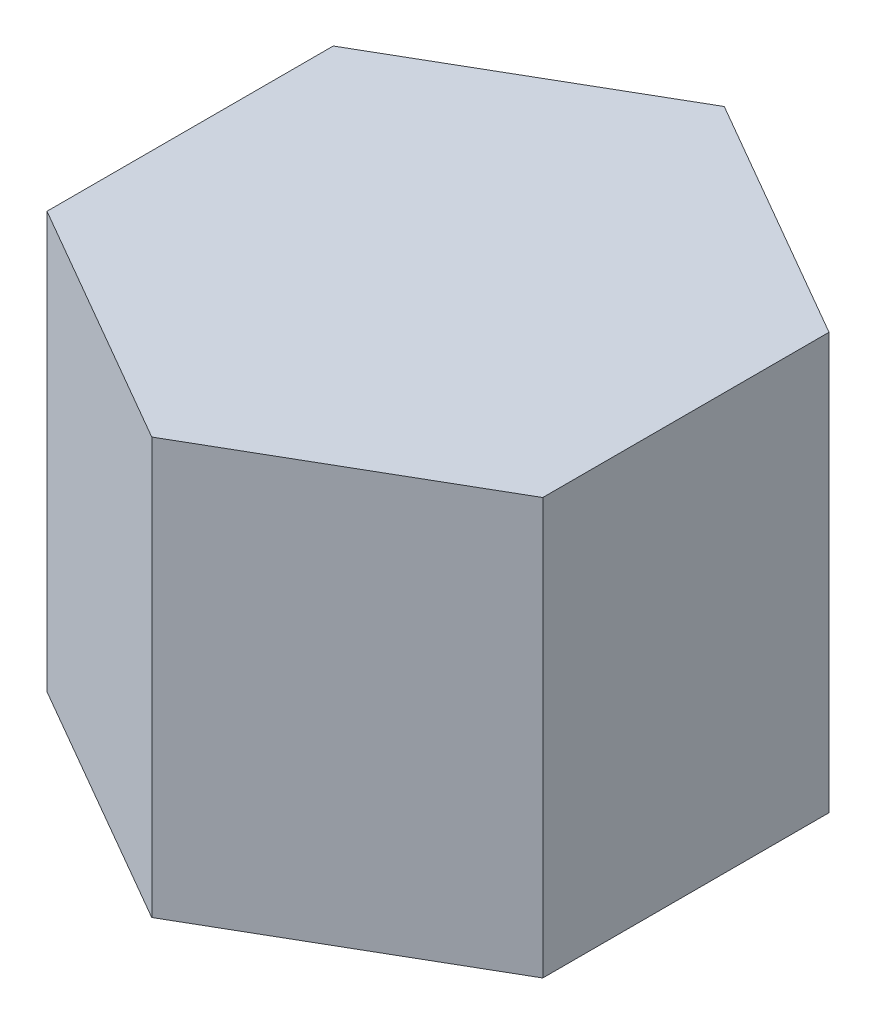
ISO-10303-21;
HEADER;
FILE_DESCRIPTION(('STEP AP214'),'2;1');
FILE_NAME('part.step','',(''),(''),'','','');
FILE_SCHEMA(('AUTOMOTIVE_DESIGN { 1 0 10303 214 1 1 1 1 }'));
ENDSEC;
DATA;
#1=APPLICATION_CONTEXT('core data for automotive mechanical design processes');
#2=APPLICATION_PROTOCOL_DEFINITION('international standard','automotive_design',2000,#1);
#3=PRODUCT_CONTEXT('',#1,'mechanical');
#4=PRODUCT('Part','Part','',(#3));
#5=PRODUCT_RELATED_PRODUCT_CATEGORY('part','',(#4));
#6=PRODUCT_DEFINITION_FORMATION('','',#4);
#7=PRODUCT_DEFINITION_CONTEXT('part definition',#1,'design');
#8=PRODUCT_DEFINITION('design','',#6,#7);
#9=PRODUCT_DEFINITION_SHAPE('','',#8);
#10=(LENGTH_UNIT() NAMED_UNIT(*) SI_UNIT(.MILLI.,.METRE.));
#11=(NAMED_UNIT(*) PLANE_ANGLE_UNIT() SI_UNIT($,.RADIAN.));
#12=(NAMED_UNIT(*) SI_UNIT($,.STERADIAN.) SOLID_ANGLE_UNIT());
#13=UNCERTAINTY_MEASURE_WITH_UNIT(LENGTH_MEASURE(1.E-05),#10,'distance_accuracy_value','');
#14=(GEOMETRIC_REPRESENTATION_CONTEXT(3) GLOBAL_UNCERTAINTY_ASSIGNED_CONTEXT((#13)) GLOBAL_UNIT_ASSIGNED_CONTEXT((#10,
#11,#12)) REPRESENTATION_CONTEXT('',''));
#15=CARTESIAN_POINT('',(0.,0.,0.));
#16=DIRECTION('',(0.,0.,1.));
#17=DIRECTION('',(1.,0.,0.));
#18=AXIS2_PLACEMENT_3D('',#15,#16,#17);
#19=CARTESIAN_POINT('',(209.839551417381,-147.556598747966,296.012098239417));
#20=DIRECTION('',(-0.500000000000062,0.,-0.866025403784403));
#21=DIRECTION('',(-0.866025403784403,0.,0.500000000000062));
#22=AXIS2_PLACEMENT_3D('',#19,#20,#21);
#23=PLANE('',#22);
#24=CARTESIAN_POINT('',(210.142660308706,-147.047793579175,295.837098239417));
#25=DIRECTION('',(-0.866025403784403,0.,0.500000000000062));
#26=VECTOR('',#25,1.);
#27=LINE('',#24,#26);
#28=CARTESIAN_POINT('',(210.142660308706,-147.047793579175,295.837098239417));
#29=VERTEX_POINT('',#28);
#30=CARTESIAN_POINT('',(209.839551417382,-147.047793579175,296.012098239417));
#31=VERTEX_POINT('',#30);
#32=EDGE_CURVE('E170',#29,#31,#27,.T.);
#33=ORIENTED_EDGE('',*,*,#32,.T.);
#34=CARTESIAN_POINT('',(209.839551417382,-147.556598747966,296.012098239417));
#35=DIRECTION('',(0.,1.,0.));
#36=VECTOR('',#35,1.);
#37=LINE('',#34,#36);
#38=CARTESIAN_POINT('',(209.839551417382,-147.556598747966,296.012098239417));
#39=VERTEX_POINT('',#38);
#40=EDGE_CURVE('E35',#39,#31,#37,.T.);
#41=ORIENTED_EDGE('',*,*,#40,.F.);
#42=CARTESIAN_POINT('',(210.142660308706,-147.556598747966,295.837098239417));
#43=DIRECTION('',(-0.866025403784403,0.,0.500000000000062));
#44=VECTOR('',#43,1.);
#45=LINE('',#42,#44);
#46=CARTESIAN_POINT('',(210.142660308706,-147.556598747966,295.837098239417));
#47=VERTEX_POINT('',#46);
#48=EDGE_CURVE('E159',#47,#39,#45,.T.);
#49=ORIENTED_EDGE('',*,*,#48,.F.);
#50=CARTESIAN_POINT('',(210.142660308706,-147.556598747966,295.837098239417));
#51=DIRECTION('',(0.,1.,0.));
#52=VECTOR('',#51,1.);
#53=LINE('',#50,#52);
#54=EDGE_CURVE('E10',#47,#29,#53,.T.);
#55=ORIENTED_EDGE('',*,*,#54,.T.);
#56=EDGE_LOOP('',(#33,#41,#49,#55));
#57=FACE_BOUND('',#56,.T.);
#58=ADVANCED_FACE('F16',(#57),#23,.F.);
#59=CARTESIAN_POINT('',(210.142660308706,-147.556598747966,291.594471220494));
#60=DIRECTION('',(-1.,0.,0.));
#61=DIRECTION('',(0.,-1.,0.));
#62=AXIS2_PLACEMENT_3D('',#59,#60,#61);
#63=PLANE('',#62);
#64=CARTESIAN_POINT('',(210.142660308706,-147.047793579175,295.487098239417));
#65=DIRECTION('',(0.,0.,1.));
#66=VECTOR('',#65,1.);
#67=LINE('',#64,#66);
#68=CARTESIAN_POINT('',(210.142660308706,-147.047793579175,295.487098239417));
#69=VERTEX_POINT('',#68);
#70=EDGE_CURVE('E167',#69,#29,#67,.T.);
#71=ORIENTED_EDGE('',*,*,#70,.T.);
#72=ORIENTED_EDGE('',*,*,#54,.F.);
#73=CARTESIAN_POINT('',(210.142660308706,-147.556598747966,295.487098239417));
#74=DIRECTION('',(0.,0.,1.));
#75=VECTOR('',#74,1.);
#76=LINE('',#73,#75);
#77=CARTESIAN_POINT('',(210.142660308706,-147.556598747966,295.487098239417));
#78=VERTEX_POINT('',#77);
#79=EDGE_CURVE('E156',#78,#47,#76,.T.);
#80=ORIENTED_EDGE('',*,*,#79,.F.);
#81=CARTESIAN_POINT('',(210.142660308706,-147.556598747966,295.487098239417));
#82=DIRECTION('',(0.,1.,0.));
#83=VECTOR('',#82,1.);
#84=LINE('',#81,#83);
#85=EDGE_CURVE('E27',#78,#69,#84,.T.);
#86=ORIENTED_EDGE('',*,*,#85,.T.);
#87=EDGE_LOOP('',(#71,#72,#80,#86));
#88=FACE_BOUND('',#87,.T.);
#89=ADVANCED_FACE('F189',(#88),#63,.F.);
#90=CARTESIAN_POINT('',(210.142660308706,-147.556598747966,295.487098239417));
#91=DIRECTION('',(-0.500000000000096,0.,0.866025403784383));
#92=DIRECTION('',(0.866025403784383,0.,0.500000000000096));
#93=AXIS2_PLACEMENT_3D('',#90,#91,#92);
#94=PLANE('',#93);
#95=CARTESIAN_POINT('',(209.839551417382,-147.047793579175,295.312098239417));
#96=DIRECTION('',(0.866025403784383,0.,0.500000000000096));
#97=VECTOR('',#96,1.);
#98=LINE('',#95,#97);
#99=CARTESIAN_POINT('',(209.839551417382,-147.047793579175,295.312098239417));
#100=VERTEX_POINT('',#99);
#101=EDGE_CURVE('E163',#100,#69,#98,.T.);
#102=ORIENTED_EDGE('',*,*,#101,.T.);
#103=ORIENTED_EDGE('',*,*,#85,.F.);
#104=CARTESIAN_POINT('',(209.839551417382,-147.556598747966,295.312098239417));
#105=DIRECTION('',(0.866025403784383,0.,0.500000000000096));
#106=VECTOR('',#105,1.);
#107=LINE('',#104,#106);
#108=CARTESIAN_POINT('',(209.839551417382,-147.556598747966,295.312098239417));
#109=VERTEX_POINT('',#108);
#110=EDGE_CURVE('E106',#109,#78,#107,.T.);
#111=ORIENTED_EDGE('',*,*,#110,.F.);
#112=CARTESIAN_POINT('',(209.839551417382,-147.556598747966,295.312098239417));
#113=DIRECTION('',(0.,1.,0.));
#114=VECTOR('',#113,1.);
#115=LINE('',#112,#114);
#116=EDGE_CURVE('E94',#109,#100,#115,.T.);
#117=ORIENTED_EDGE('',*,*,#116,.T.);
#118=EDGE_LOOP('',(#102,#103,#111,#117));
#119=FACE_BOUND('',#118,.T.);
#120=ADVANCED_FACE('F198',(#119),#94,.F.);
#121=CARTESIAN_POINT('',(209.839551417382,-147.556598747966,295.312098239417));
#122=DIRECTION('',(0.499999999999978,0.,0.866025403784452));
#123=DIRECTION('',(0.866025403784452,0.,-0.499999999999978));
#124=AXIS2_PLACEMENT_3D('',#121,#122,#123);
#125=PLANE('',#124);
#126=CARTESIAN_POINT('',(209.536442526057,-147.047793579175,295.487098239417));
#127=DIRECTION('',(0.866025403784452,0.,-0.499999999999978));
#128=VECTOR('',#127,1.);
#129=LINE('',#126,#128);
#130=CARTESIAN_POINT('',(209.536442526057,-147.047793579175,295.487098239417));
#131=VERTEX_POINT('',#130);
#132=EDGE_CURVE('E162',#131,#100,#129,.T.);
#133=ORIENTED_EDGE('',*,*,#132,.T.);
#134=ORIENTED_EDGE('',*,*,#116,.F.);
#135=CARTESIAN_POINT('',(209.536442526057,-147.556598747966,295.487098239417));
#136=DIRECTION('',(0.866025403784452,0.,-0.499999999999978));
#137=VECTOR('',#136,1.);
#138=LINE('',#135,#137);
#139=CARTESIAN_POINT('',(209.536442526057,-147.556598747966,295.487098239417));
#140=VERTEX_POINT('',#139);
#141=EDGE_CURVE('E98',#140,#109,#138,.T.);
#142=ORIENTED_EDGE('',*,*,#141,.F.);
#143=CARTESIAN_POINT('',(209.536442526057,-147.556598747966,295.487098239417));
#144=DIRECTION('',(0.,1.,0.));
#145=VECTOR('',#144,1.);
#146=LINE('',#143,#145);
#147=EDGE_CURVE('E79',#140,#131,#146,.T.);
#148=ORIENTED_EDGE('',*,*,#147,.T.);
#149=EDGE_LOOP('',(#133,#134,#142,#148));
#150=FACE_BOUND('',#149,.T.);
#151=ADVANCED_FACE('F100',(#150),#125,.F.);
#152=CARTESIAN_POINT('',(209.536442526057,-147.556598747966,291.594471220494));
#153=DIRECTION('',(1.,0.,0.));
#154=DIRECTION('',(0.,1.,0.));
#155=AXIS2_PLACEMENT_3D('',#152,#153,#154);
#156=PLANE('',#155);
#157=CARTESIAN_POINT('',(209.536442526057,-147.047793579175,295.837098239417));
#158=DIRECTION('',(0.,0.,-1.));
#159=VECTOR('',#158,1.);
#160=LINE('',#157,#159);
#161=CARTESIAN_POINT('',(209.536442526057,-147.047793579175,295.837098239417));
#162=VERTEX_POINT('',#161);
#163=EDGE_CURVE('E88',#162,#131,#160,.T.);
#164=ORIENTED_EDGE('',*,*,#163,.T.);
#165=ORIENTED_EDGE('',*,*,#147,.F.);
#166=CARTESIAN_POINT('',(209.536442526057,-147.556598747966,295.837098239417));
#167=DIRECTION('',(0.,0.,-1.));
#168=VECTOR('',#167,1.);
#169=LINE('',#166,#168);
#170=CARTESIAN_POINT('',(209.536442526057,-147.556598747966,295.837098239417));
#171=VERTEX_POINT('',#170);
#172=EDGE_CURVE('E84',#171,#140,#169,.T.);
#173=ORIENTED_EDGE('',*,*,#172,.F.);
#174=CARTESIAN_POINT('',(209.536442526057,-147.556598747966,295.837098239417));
#175=DIRECTION('',(0.,1.,0.));
#176=VECTOR('',#175,1.);
#177=LINE('',#174,#176);
#178=EDGE_CURVE('E58',#171,#162,#177,.T.);
#179=ORIENTED_EDGE('',*,*,#178,.T.);
#180=EDGE_LOOP('',(#164,#165,#173,#179));
#181=FACE_BOUND('',#180,.T.);
#182=ADVANCED_FACE('F82',(#181),#156,.F.);
#183=CARTESIAN_POINT('',(209.536442526057,-147.556598747966,295.837098239417));
#184=DIRECTION('',(0.500000000000062,0.,-0.866025403784403));
#185=DIRECTION('',(-0.866025403784403,0.,-0.500000000000062));
#186=AXIS2_PLACEMENT_3D('',#183,#184,#185);
#187=PLANE('',#186);
#188=CARTESIAN_POINT('',(209.839551417382,-147.047793579175,296.012098239417));
#189=DIRECTION('',(-0.866025403784403,0.,-0.500000000000062));
#190=VECTOR('',#189,1.);
#191=LINE('',#188,#190);
#192=EDGE_CURVE('E160',#31,#162,#191,.T.);
#193=ORIENTED_EDGE('',*,*,#192,.T.);
#194=ORIENTED_EDGE('',*,*,#178,.F.);
#195=CARTESIAN_POINT('',(209.839551417382,-147.556598747966,296.012098239417));
#196=DIRECTION('',(-0.866025403784403,0.,-0.500000000000062));
#197=VECTOR('',#196,1.);
#198=LINE('',#195,#197);
#199=EDGE_CURVE('E112',#39,#171,#198,.T.);
#200=ORIENTED_EDGE('',*,*,#199,.F.);
#201=ORIENTED_EDGE('',*,*,#40,.T.);
#202=EDGE_LOOP('',(#193,#194,#200,#201));
#203=FACE_BOUND('',#202,.T.);
#204=ADVANCED_FACE('F131',(#203),#187,.F.);
#205=CARTESIAN_POINT('',(206.491105863044,-147.556598747966,291.594471220494));
#206=DIRECTION('',(0.,1.,0.));
#207=DIRECTION('',(-1.,0.,0.));
#208=AXIS2_PLACEMENT_3D('',#205,#206,#207);
#209=PLANE('',#208);
#210=ORIENTED_EDGE('',*,*,#48,.T.);
#211=ORIENTED_EDGE('',*,*,#199,.T.);
#212=ORIENTED_EDGE('',*,*,#172,.T.);
#213=ORIENTED_EDGE('',*,*,#141,.T.);
#214=ORIENTED_EDGE('',*,*,#110,.T.);
#215=ORIENTED_EDGE('',*,*,#79,.T.);
#216=EDGE_LOOP('',(#210,#211,#212,#213,#214,#215));
#217=FACE_BOUND('',#216,.T.);
#218=ADVANCED_FACE('F111',(#217),#209,.F.);
#219=CARTESIAN_POINT('',(206.491105863044,-147.047793579175,291.594471220494));
#220=DIRECTION('',(0.,1.,0.));
#221=DIRECTION('',(-1.,0.,0.));
#222=AXIS2_PLACEMENT_3D('',#219,#220,#221);
#223=PLANE('',#222);
#224=ORIENTED_EDGE('',*,*,#32,.F.);
#225=ORIENTED_EDGE('',*,*,#70,.F.);
#226=ORIENTED_EDGE('',*,*,#101,.F.);
#227=ORIENTED_EDGE('',*,*,#132,.F.);
#228=ORIENTED_EDGE('',*,*,#163,.F.);
#229=ORIENTED_EDGE('',*,*,#192,.F.);
#230=EDGE_LOOP('',(#224,#225,#226,#227,#228,#229));
#231=FACE_BOUND('',#230,.T.);
#232=ADVANCED_FACE('F130',(#231),#223,.T.);
#233=CLOSED_SHELL('',(#58,#89,#120,#151,#182,#204,#218,#232));
#234=MANIFOLD_SOLID_BREP('B1',#233);
#235=ADVANCED_BREP_SHAPE_REPRESENTATION('',(#18,#234),#14);
#236=SHAPE_DEFINITION_REPRESENTATION(#9,#235);
ENDSEC;
END-ISO-10303-21;
